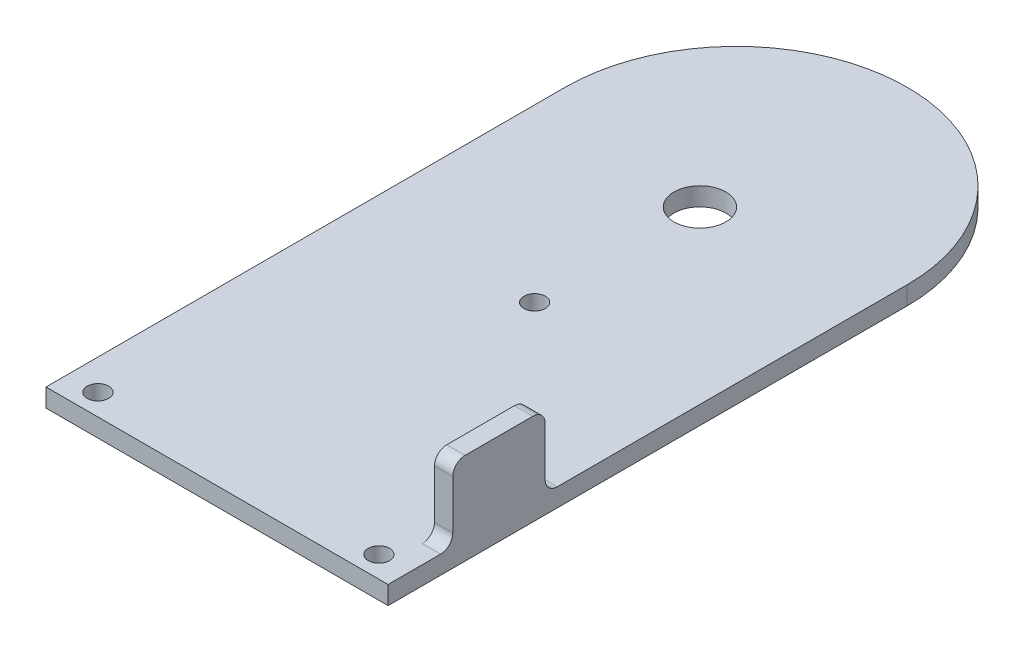
ISO-10303-21;
HEADER;
FILE_DESCRIPTION(('STEP AP214'),'2;1');
FILE_NAME('part.step','',(''),(''),'','','');
FILE_SCHEMA(('AUTOMOTIVE_DESIGN { 1 0 10303 214 1 1 1 1 }'));
ENDSEC;
DATA;
#1=APPLICATION_CONTEXT('core data for automotive mechanical design processes');
#2=APPLICATION_PROTOCOL_DEFINITION('international standard','automotive_design',2000,#1);
#3=PRODUCT_CONTEXT('',#1,'mechanical');
#4=PRODUCT('Part','Part','',(#3));
#5=PRODUCT_RELATED_PRODUCT_CATEGORY('part','',(#4));
#6=PRODUCT_DEFINITION_FORMATION('','',#4);
#7=PRODUCT_DEFINITION_CONTEXT('part definition',#1,'design');
#8=PRODUCT_DEFINITION('design','',#6,#7);
#9=PRODUCT_DEFINITION_SHAPE('','',#8);
#10=(LENGTH_UNIT() NAMED_UNIT(*) SI_UNIT(.MILLI.,.METRE.));
#11=(NAMED_UNIT(*) PLANE_ANGLE_UNIT() SI_UNIT($,.RADIAN.));
#12=(NAMED_UNIT(*) SI_UNIT($,.STERADIAN.) SOLID_ANGLE_UNIT());
#13=UNCERTAINTY_MEASURE_WITH_UNIT(LENGTH_MEASURE(1.E-05),#10,'distance_accuracy_value','');
#14=(GEOMETRIC_REPRESENTATION_CONTEXT(3) GLOBAL_UNCERTAINTY_ASSIGNED_CONTEXT((#13)) GLOBAL_UNIT_ASSIGNED_CONTEXT((#10,
#11,#12)) REPRESENTATION_CONTEXT('',''));
#15=CARTESIAN_POINT('',(0.,0.,0.));
#16=DIRECTION('',(0.,0.,1.));
#17=DIRECTION('',(1.,0.,0.));
#18=AXIS2_PLACEMENT_3D('',#15,#16,#17);
#19=CARTESIAN_POINT('',(28.,3.,-3.28618853211554E-08));
#20=DIRECTION('',(0.,1.,0.));
#21=DIRECTION('',(0.,0.,1.));
#22=AXIS2_PLACEMENT_3D('',#19,#20,#21);
#23=PLANE('',#22);
#24=DIRECTION('',(0.,0.,-1.));
#25=VECTOR('',#24,1.);
#26=CARTESIAN_POINT('',(56.,3.,-6.57237706423107E-08));
#27=LINE('',#26,#25);
#28=CARTESIAN_POINT('',(56.,3.,85.));
#29=VERTEX_POINT('',#28);
#30=CARTESIAN_POINT('',(56.,3.,76.4020341698814));
#31=VERTEX_POINT('',#30);
#32=EDGE_CURVE('E203',#29,#31,#27,.T.);
#33=ORIENTED_EDGE('',*,*,#32,.T.);
#34=DIRECTION('',(1.,0.,0.));
#35=VECTOR('',#34,1.);
#36=CARTESIAN_POINT('',(28.,3.,76.4020341698814));
#37=LINE('',#36,#35);
#38=CARTESIAN_POINT('',(53.,3.,76.4020341698814));
#39=VERTEX_POINT('',#38);
#40=EDGE_CURVE('E165',#31,#39,#37,.F.);
#41=ORIENTED_EDGE('',*,*,#40,.T.);
#42=DIRECTION('',(0.,0.,1.));
#43=VECTOR('',#42,1.);
#44=CARTESIAN_POINT('',(53.,3.,74.4020341698814));
#45=LINE('',#44,#43);
#46=CARTESIAN_POINT('',(53.,3.,57.2862585671108));
#47=VERTEX_POINT('',#46);
#48=EDGE_CURVE('E191',#47,#39,#45,.T.);
#49=ORIENTED_EDGE('',*,*,#48,.F.);
#50=DIRECTION('',(-1.,0.,0.));
#51=VECTOR('',#50,1.);
#52=CARTESIAN_POINT('',(28.,3.,57.2862585671108));
#53=LINE('',#52,#51);
#54=CARTESIAN_POINT('',(56.,3.,57.2862585671108));
#55=VERTEX_POINT('',#54);
#56=EDGE_CURVE('E163',#47,#55,#53,.F.);
#57=ORIENTED_EDGE('',*,*,#56,.T.);
#58=CARTESIAN_POINT('',(56.,3.,-6.57237706423107E-08));
#59=VERTEX_POINT('',#58);
#60=EDGE_CURVE('E144',#55,#59,#27,.T.);
#61=ORIENTED_EDGE('',*,*,#60,.T.);
#62=CARTESIAN_POINT('',(28.,3.,-3.28618853211554E-08));
#63=DIRECTION('',(0.,1.,0.));
#64=DIRECTION('',(0.,0.,1.));
#65=AXIS2_PLACEMENT_3D('',#62,#63,#64);
#66=CIRCLE('',#65,28.);
#67=CARTESIAN_POINT('',(0.,3.,0.));
#68=VERTEX_POINT('',#67);
#69=EDGE_CURVE('E138',#59,#68,#66,.T.);
#70=ORIENTED_EDGE('',*,*,#69,.T.);
#71=DIRECTION('',(0.,0.,1.));
#72=VECTOR('',#71,1.);
#73=CARTESIAN_POINT('',(0.,3.,0.));
#74=LINE('',#73,#72);
#75=CARTESIAN_POINT('',(0.,3.,85.));
#76=VERTEX_POINT('',#75);
#77=EDGE_CURVE('E127',#68,#76,#74,.T.);
#78=ORIENTED_EDGE('',*,*,#77,.T.);
#79=DIRECTION('',(1.,0.,0.));
#80=VECTOR('',#79,1.);
#81=CARTESIAN_POINT('',(0.,3.,85.));
#82=LINE('',#81,#80);
#83=EDGE_CURVE('E137',#76,#29,#82,.T.);
#84=ORIENTED_EDGE('',*,*,#83,.T.);
#85=EDGE_LOOP('',(#33,#41,#49,#57,#61,#70,#78,#84));
#86=FACE_BOUND('',#85,.T.);
#87=CARTESIAN_POINT('',(28.,3.,33.));
#88=DIRECTION('',(0.,1.,0.));
#89=DIRECTION('',(0.,0.,1.));
#90=AXIS2_PLACEMENT_3D('',#87,#88,#89);
#91=CIRCLE('',#90,1.75);
#92=CARTESIAN_POINT('',(28.,3.,34.75));
#93=VERTEX_POINT('',#92);
#94=EDGE_CURVE('E252',#93,#93,#91,.T.);
#95=ORIENTED_EDGE('',*,*,#94,.F.);
#96=EDGE_LOOP('',(#95));
#97=FACE_BOUND('',#96,.T.);
#98=CARTESIAN_POINT('',(5.00000000000001,3.,81.5));
#99=DIRECTION('',(0.,1.,0.));
#100=DIRECTION('',(0.,0.,1.));
#101=AXIS2_PLACEMENT_3D('',#98,#99,#100);
#102=CIRCLE('',#101,1.75);
#103=CARTESIAN_POINT('',(5.00000000000001,3.,83.25));
#104=VERTEX_POINT('',#103);
#105=EDGE_CURVE('E209',#104,#104,#102,.T.);
#106=ORIENTED_EDGE('',*,*,#105,.F.);
#107=EDGE_LOOP('',(#106));
#108=FACE_BOUND('',#107,.T.);
#109=CARTESIAN_POINT('',(51.,3.,81.5));
#110=DIRECTION('',(0.,1.,0.));
#111=DIRECTION('',(0.,0.,1.));
#112=AXIS2_PLACEMENT_3D('',#109,#110,#111);
#113=CIRCLE('',#112,1.75);
#114=CARTESIAN_POINT('',(51.,3.,83.25));
#115=VERTEX_POINT('',#114);
#116=EDGE_CURVE('E258',#115,#115,#113,.T.);
#117=ORIENTED_EDGE('',*,*,#116,.F.);
#118=EDGE_LOOP('',(#117));
#119=FACE_BOUND('',#118,.T.);
#120=CARTESIAN_POINT('',(28.,3.,5.94000000000001));
#121=DIRECTION('',(0.,1.,0.));
#122=DIRECTION('',(0.,0.,1.));
#123=AXIS2_PLACEMENT_3D('',#120,#121,#122);
#124=CIRCLE('',#123,4.25);
#125=CARTESIAN_POINT('',(28.,3.,10.19));
#126=VERTEX_POINT('',#125);
#127=EDGE_CURVE('E246',#126,#126,#124,.T.);
#128=ORIENTED_EDGE('',*,*,#127,.F.);
#129=EDGE_LOOP('',(#128));
#130=FACE_BOUND('',#129,.T.);
#131=ADVANCED_FACE('F36',(#86,#97,#108,#119,#130),#23,.T.);
#132=CARTESIAN_POINT('',(28.,0.,-3.28618853211554E-08));
#133=DIRECTION('',(0.,1.,0.));
#134=DIRECTION('',(0.,0.,1.));
#135=AXIS2_PLACEMENT_3D('',#132,#133,#134);
#136=PLANE('',#135);
#137=CARTESIAN_POINT('',(28.,0.,-3.28618853211554E-08));
#138=DIRECTION('',(0.,1.,0.));
#139=DIRECTION('',(0.,0.,1.));
#140=AXIS2_PLACEMENT_3D('',#137,#138,#139);
#141=CIRCLE('',#140,28.);
#142=CARTESIAN_POINT('',(56.,0.,-6.57237706423107E-08));
#143=VERTEX_POINT('',#142);
#144=CARTESIAN_POINT('',(0.,0.,0.));
#145=VERTEX_POINT('',#144);
#146=EDGE_CURVE('E152',#143,#145,#141,.T.);
#147=ORIENTED_EDGE('',*,*,#146,.F.);
#148=DIRECTION('',(0.,0.,-1.));
#149=VECTOR('',#148,1.);
#150=CARTESIAN_POINT('',(56.,0.,-6.57237706423107E-08));
#151=LINE('',#150,#149);
#152=CARTESIAN_POINT('',(56.,0.,85.));
#153=VERTEX_POINT('',#152);
#154=EDGE_CURVE('E148',#153,#143,#151,.T.);
#155=ORIENTED_EDGE('',*,*,#154,.F.);
#156=DIRECTION('',(1.,0.,0.));
#157=VECTOR('',#156,1.);
#158=CARTESIAN_POINT('',(0.,0.,85.));
#159=LINE('',#158,#157);
#160=CARTESIAN_POINT('',(0.,0.,85.));
#161=VERTEX_POINT('',#160);
#162=EDGE_CURVE('E211',#161,#153,#159,.T.);
#163=ORIENTED_EDGE('',*,*,#162,.F.);
#164=DIRECTION('',(0.,0.,1.));
#165=VECTOR('',#164,1.);
#166=CARTESIAN_POINT('',(0.,0.,0.));
#167=LINE('',#166,#165);
#168=EDGE_CURVE('E208',#145,#161,#167,.T.);
#169=ORIENTED_EDGE('',*,*,#168,.F.);
#170=EDGE_LOOP('',(#147,#155,#163,#169));
#171=FACE_BOUND('',#170,.T.);
#172=CARTESIAN_POINT('',(5.00000000000001,0.,81.5));
#173=DIRECTION('',(0.,1.,0.));
#174=DIRECTION('',(0.,0.,1.));
#175=AXIS2_PLACEMENT_3D('',#172,#173,#174);
#176=CIRCLE('',#175,1.75);
#177=CARTESIAN_POINT('',(5.00000000000001,0.,83.25));
#178=VERTEX_POINT('',#177);
#179=EDGE_CURVE('E261',#178,#178,#176,.T.);
#180=ORIENTED_EDGE('',*,*,#179,.T.);
#181=EDGE_LOOP('',(#180));
#182=FACE_BOUND('',#181,.T.);
#183=CARTESIAN_POINT('',(51.,0.,81.5));
#184=DIRECTION('',(0.,1.,0.));
#185=DIRECTION('',(0.,0.,1.));
#186=AXIS2_PLACEMENT_3D('',#183,#184,#185);
#187=CIRCLE('',#186,1.75);
#188=CARTESIAN_POINT('',(51.,0.,83.25));
#189=VERTEX_POINT('',#188);
#190=EDGE_CURVE('E255',#189,#189,#187,.T.);
#191=ORIENTED_EDGE('',*,*,#190,.T.);
#192=EDGE_LOOP('',(#191));
#193=FACE_BOUND('',#192,.T.);
#194=CARTESIAN_POINT('',(28.,0.,33.));
#195=DIRECTION('',(0.,1.,0.));
#196=DIRECTION('',(0.,0.,1.));
#197=AXIS2_PLACEMENT_3D('',#194,#195,#196);
#198=CIRCLE('',#197,1.75);
#199=CARTESIAN_POINT('',(28.,0.,34.75));
#200=VERTEX_POINT('',#199);
#201=EDGE_CURVE('E249',#200,#200,#198,.T.);
#202=ORIENTED_EDGE('',*,*,#201,.T.);
#203=EDGE_LOOP('',(#202));
#204=FACE_BOUND('',#203,.T.);
#205=CARTESIAN_POINT('',(28.,0.,5.94000000000001));
#206=DIRECTION('',(0.,1.,0.));
#207=DIRECTION('',(0.,0.,1.));
#208=AXIS2_PLACEMENT_3D('',#205,#206,#207);
#209=CIRCLE('',#208,4.25);
#210=CARTESIAN_POINT('',(28.,0.,10.19));
#211=VERTEX_POINT('',#210);
#212=EDGE_CURVE('E245',#211,#211,#209,.T.);
#213=ORIENTED_EDGE('',*,*,#212,.T.);
#214=EDGE_LOOP('',(#213));
#215=FACE_BOUND('',#214,.T.);
#216=ADVANCED_FACE('F221',(#171,#182,#193,#204,#215),#136,.F.);
#217=CARTESIAN_POINT('',(28.,3.,-3.28618853211554E-08));
#218=DIRECTION('',(0.,-1.,0.));
#219=DIRECTION('',(0.,0.,-1.));
#220=AXIS2_PLACEMENT_3D('',#217,#218,#219);
#221=CYLINDRICAL_SURFACE('',#220,28.);
#222=ORIENTED_EDGE('',*,*,#146,.T.);
#223=DIRECTION('',(0.,-1.,0.));
#224=VECTOR('',#223,1.);
#225=CARTESIAN_POINT('',(0.,3.,0.));
#226=LINE('',#225,#224);
#227=EDGE_CURVE('E131',#68,#145,#226,.T.);
#228=ORIENTED_EDGE('',*,*,#227,.F.);
#229=ORIENTED_EDGE('',*,*,#69,.F.);
#230=DIRECTION('',(0.,-1.,0.));
#231=VECTOR('',#230,1.);
#232=CARTESIAN_POINT('',(56.,3.,-6.57237706423107E-08));
#233=LINE('',#232,#231);
#234=EDGE_CURVE('E202',#59,#143,#233,.T.);
#235=ORIENTED_EDGE('',*,*,#234,.T.);
#236=EDGE_LOOP('',(#222,#228,#229,#235));
#237=FACE_BOUND('',#236,.T.);
#238=ADVANCED_FACE('F150',(#237),#221,.T.);
#239=CARTESIAN_POINT('',(0.,3.,0.));
#240=DIRECTION('',(1.,0.,0.));
#241=DIRECTION('',(0.,0.,-1.));
#242=AXIS2_PLACEMENT_3D('',#239,#240,#241);
#243=PLANE('',#242);
#244=ORIENTED_EDGE('',*,*,#168,.T.);
#245=DIRECTION('',(0.,-1.,0.));
#246=VECTOR('',#245,1.);
#247=CARTESIAN_POINT('',(0.,3.,85.));
#248=LINE('',#247,#246);
#249=EDGE_CURVE('E134',#76,#161,#248,.T.);
#250=ORIENTED_EDGE('',*,*,#249,.F.);
#251=ORIENTED_EDGE('',*,*,#77,.F.);
#252=ORIENTED_EDGE('',*,*,#227,.T.);
#253=EDGE_LOOP('',(#244,#250,#251,#252));
#254=FACE_BOUND('',#253,.T.);
#255=ADVANCED_FACE('F129',(#254),#243,.F.);
#256=CARTESIAN_POINT('',(0.,3.,85.));
#257=DIRECTION('',(0.,0.,-1.));
#258=DIRECTION('',(-1.,0.,0.));
#259=AXIS2_PLACEMENT_3D('',#256,#257,#258);
#260=PLANE('',#259);
#261=ORIENTED_EDGE('',*,*,#162,.T.);
#262=DIRECTION('',(0.,-1.,0.));
#263=VECTOR('',#262,1.);
#264=CARTESIAN_POINT('',(56.,3.,85.));
#265=LINE('',#264,#263);
#266=EDGE_CURVE('E157',#29,#153,#265,.T.);
#267=ORIENTED_EDGE('',*,*,#266,.F.);
#268=ORIENTED_EDGE('',*,*,#83,.F.);
#269=ORIENTED_EDGE('',*,*,#249,.T.);
#270=EDGE_LOOP('',(#261,#267,#268,#269));
#271=FACE_BOUND('',#270,.T.);
#272=ADVANCED_FACE('F223',(#271),#260,.F.);
#273=CARTESIAN_POINT('',(56.,3.,-6.57237706423107E-08));
#274=DIRECTION('',(-1.,0.,0.));
#275=DIRECTION('',(0.,0.,1.));
#276=AXIS2_PLACEMENT_3D('',#273,#274,#275);
#277=PLANE('',#276);
#278=DIRECTION('',(0.,-1.,0.));
#279=VECTOR('',#278,1.);
#280=CARTESIAN_POINT('',(56.,15.,59.2862585671108));
#281=LINE('',#280,#279);
#282=CARTESIAN_POINT('',(56.,13.,59.2862585671108));
#283=VERTEX_POINT('',#282);
#284=CARTESIAN_POINT('',(56.,5.,59.2862585671108));
#285=VERTEX_POINT('',#284);
#286=EDGE_CURVE('E238',#283,#285,#281,.T.);
#287=ORIENTED_EDGE('',*,*,#286,.F.);
#288=CARTESIAN_POINT('',(56.,13.,61.2862585671108));
#289=DIRECTION('',(-1.,0.,0.));
#290=DIRECTION('',(0.,0.,1.));
#291=AXIS2_PLACEMENT_3D('',#288,#289,#290);
#292=CIRCLE('',#291,2.);
#293=CARTESIAN_POINT('',(56.,15.,61.2862585671108));
#294=VERTEX_POINT('',#293);
#295=EDGE_CURVE('E182',#283,#294,#292,.F.);
#296=ORIENTED_EDGE('',*,*,#295,.T.);
#297=DIRECTION('',(0.,0.,-1.));
#298=VECTOR('',#297,1.);
#299=CARTESIAN_POINT('',(56.,15.,74.4020341698814));
#300=LINE('',#299,#298);
#301=CARTESIAN_POINT('',(56.,15.,72.4020341698814));
#302=VERTEX_POINT('',#301);
#303=EDGE_CURVE('E309',#302,#294,#300,.T.);
#304=ORIENTED_EDGE('',*,*,#303,.F.);
#305=CARTESIAN_POINT('',(56.,13.,72.4020341698814));
#306=DIRECTION('',(-1.,0.,0.));
#307=DIRECTION('',(0.,0.,1.));
#308=AXIS2_PLACEMENT_3D('',#305,#306,#307);
#309=CIRCLE('',#308,2.);
#310=CARTESIAN_POINT('',(56.,13.,74.4020341698814));
#311=VERTEX_POINT('',#310);
#312=EDGE_CURVE('E180',#302,#311,#309,.F.);
#313=ORIENTED_EDGE('',*,*,#312,.T.);
#314=DIRECTION('',(0.,-1.,0.));
#315=VECTOR('',#314,1.);
#316=CARTESIAN_POINT('',(56.,15.,74.4020341698814));
#317=LINE('',#316,#315);
#318=CARTESIAN_POINT('',(56.,5.,74.4020341698814));
#319=VERTEX_POINT('',#318);
#320=EDGE_CURVE('E236',#311,#319,#317,.T.);
#321=ORIENTED_EDGE('',*,*,#320,.T.);
#322=CARTESIAN_POINT('',(56.,5.,76.4020341698814));
#323=DIRECTION('',(-1.,0.,0.));
#324=DIRECTION('',(0.,0.,1.));
#325=AXIS2_PLACEMENT_3D('',#322,#323,#324);
#326=CIRCLE('',#325,2.);
#327=EDGE_CURVE('E184',#319,#31,#326,.T.);
#328=ORIENTED_EDGE('',*,*,#327,.T.);
#329=ORIENTED_EDGE('',*,*,#32,.F.);
#330=ORIENTED_EDGE('',*,*,#266,.T.);
#331=ORIENTED_EDGE('',*,*,#154,.T.);
#332=ORIENTED_EDGE('',*,*,#234,.F.);
#333=ORIENTED_EDGE('',*,*,#60,.F.);
#334=CARTESIAN_POINT('',(56.,5.,57.2862585671108));
#335=DIRECTION('',(-1.,0.,0.));
#336=DIRECTION('',(0.,0.,1.));
#337=AXIS2_PLACEMENT_3D('',#334,#335,#336);
#338=CIRCLE('',#337,2.);
#339=EDGE_CURVE('E11',#55,#285,#338,.T.);
#340=ORIENTED_EDGE('',*,*,#339,.T.);
#341=EDGE_LOOP('',(#287,#296,#304,#313,#321,#328,#329,#330,#331,#332,#333,#340));
#342=FACE_BOUND('',#341,.T.);
#343=ADVANCED_FACE('F200',(#342),#277,.F.);
#344=CARTESIAN_POINT('',(5.00000000000001,3.,81.5));
#345=DIRECTION('',(0.,-1.,0.));
#346=DIRECTION('',(0.,0.,-1.));
#347=AXIS2_PLACEMENT_3D('',#344,#345,#346);
#348=CYLINDRICAL_SURFACE('',#347,1.75);
#349=ORIENTED_EDGE('',*,*,#105,.T.);
#350=EDGE_LOOP('',(#349));
#351=FACE_BOUND('',#350,.T.);
#352=ORIENTED_EDGE('',*,*,#179,.F.);
#353=EDGE_LOOP('',(#352));
#354=FACE_BOUND('',#353,.T.);
#355=ADVANCED_FACE('F270',(#351,#354),#348,.F.);
#356=CARTESIAN_POINT('',(51.,3.,81.5));
#357=DIRECTION('',(0.,-1.,0.));
#358=DIRECTION('',(0.,0.,-1.));
#359=AXIS2_PLACEMENT_3D('',#356,#357,#358);
#360=CYLINDRICAL_SURFACE('',#359,1.75);
#361=ORIENTED_EDGE('',*,*,#116,.T.);
#362=EDGE_LOOP('',(#361));
#363=FACE_BOUND('',#362,.T.);
#364=ORIENTED_EDGE('',*,*,#190,.F.);
#365=EDGE_LOOP('',(#364));
#366=FACE_BOUND('',#365,.T.);
#367=ADVANCED_FACE('F272',(#363,#366),#360,.F.);
#368=CARTESIAN_POINT('',(28.,3.,33.));
#369=DIRECTION('',(0.,-1.,0.));
#370=DIRECTION('',(0.,0.,-1.));
#371=AXIS2_PLACEMENT_3D('',#368,#369,#370);
#372=CYLINDRICAL_SURFACE('',#371,1.75);
#373=ORIENTED_EDGE('',*,*,#94,.T.);
#374=EDGE_LOOP('',(#373));
#375=FACE_BOUND('',#374,.T.);
#376=ORIENTED_EDGE('',*,*,#201,.F.);
#377=EDGE_LOOP('',(#376));
#378=FACE_BOUND('',#377,.T.);
#379=ADVANCED_FACE('F279',(#375,#378),#372,.F.);
#380=CARTESIAN_POINT('',(28.,3.,5.94000000000001));
#381=DIRECTION('',(0.,-1.,0.));
#382=DIRECTION('',(0.,0.,-1.));
#383=AXIS2_PLACEMENT_3D('',#380,#381,#382);
#384=CYLINDRICAL_SURFACE('',#383,4.25);
#385=ORIENTED_EDGE('',*,*,#127,.T.);
#386=EDGE_LOOP('',(#385));
#387=FACE_BOUND('',#386,.T.);
#388=ORIENTED_EDGE('',*,*,#212,.F.);
#389=EDGE_LOOP('',(#388));
#390=FACE_BOUND('',#389,.T.);
#391=ADVANCED_FACE('F317',(#387,#390),#384,.F.);
#392=CARTESIAN_POINT('',(56.,15.,59.2862585671108));
#393=DIRECTION('',(0.,0.,1.));
#394=DIRECTION('',(1.,0.,0.));
#395=AXIS2_PLACEMENT_3D('',#392,#393,#394);
#396=PLANE('',#395);
#397=ORIENTED_EDGE('',*,*,#286,.T.);
#398=DIRECTION('',(-1.,0.,0.));
#399=VECTOR('',#398,1.);
#400=CARTESIAN_POINT('',(56.,5.,59.2862585671108));
#401=LINE('',#400,#399);
#402=CARTESIAN_POINT('',(53.,5.,59.2862585671108));
#403=VERTEX_POINT('',#402);
#404=EDGE_CURVE('E170',#285,#403,#401,.T.);
#405=ORIENTED_EDGE('',*,*,#404,.T.);
#406=DIRECTION('',(0.,-1.,0.));
#407=VECTOR('',#406,1.);
#408=CARTESIAN_POINT('',(53.,15.,59.2862585671108));
#409=LINE('',#408,#407);
#410=CARTESIAN_POINT('',(53.,13.,59.2862585671108));
#411=VERTEX_POINT('',#410);
#412=EDGE_CURVE('E193',#411,#403,#409,.T.);
#413=ORIENTED_EDGE('',*,*,#412,.F.);
#414=DIRECTION('',(-1.,0.,0.));
#415=VECTOR('',#414,1.);
#416=CARTESIAN_POINT('',(56.,13.,59.2862585671108));
#417=LINE('',#416,#415);
#418=EDGE_CURVE('E168',#411,#283,#417,.F.);
#419=ORIENTED_EDGE('',*,*,#418,.T.);
#420=EDGE_LOOP('',(#397,#405,#413,#419));
#421=FACE_BOUND('',#420,.T.);
#422=ADVANCED_FACE('F315',(#421),#396,.F.);
#423=CARTESIAN_POINT('',(53.,15.,74.4020341698814));
#424=DIRECTION('',(1.,0.,0.));
#425=DIRECTION('',(0.,0.,-1.));
#426=AXIS2_PLACEMENT_3D('',#423,#424,#425);
#427=PLANE('',#426);
#428=DIRECTION('',(0.,0.,1.));
#429=VECTOR('',#428,1.);
#430=CARTESIAN_POINT('',(53.,15.,74.4020341698814));
#431=LINE('',#430,#429);
#432=CARTESIAN_POINT('',(53.,15.,61.2862585671108));
#433=VERTEX_POINT('',#432);
#434=CARTESIAN_POINT('',(53.,15.,72.4020341698814));
#435=VERTEX_POINT('',#434);
#436=EDGE_CURVE('E240',#433,#435,#431,.T.);
#437=ORIENTED_EDGE('',*,*,#436,.F.);
#438=CARTESIAN_POINT('',(53.,13.,61.2862585671108));
#439=DIRECTION('',(1.,0.,0.));
#440=DIRECTION('',(0.,0.,-1.));
#441=AXIS2_PLACEMENT_3D('',#438,#439,#440);
#442=CIRCLE('',#441,2.);
#443=EDGE_CURVE('E59',#433,#411,#442,.F.);
#444=ORIENTED_EDGE('',*,*,#443,.T.);
#445=ORIENTED_EDGE('',*,*,#412,.T.);
#446=CARTESIAN_POINT('',(53.,5.,57.2862585671108));
#447=DIRECTION('',(1.,0.,0.));
#448=DIRECTION('',(0.,0.,-1.));
#449=AXIS2_PLACEMENT_3D('',#446,#447,#448);
#450=CIRCLE('',#449,2.);
#451=EDGE_CURVE('E44',#403,#47,#450,.T.);
#452=ORIENTED_EDGE('',*,*,#451,.T.);
#453=ORIENTED_EDGE('',*,*,#48,.T.);
#454=CARTESIAN_POINT('',(53.,5.,76.4020341698814));
#455=DIRECTION('',(1.,0.,0.));
#456=DIRECTION('',(0.,0.,-1.));
#457=AXIS2_PLACEMENT_3D('',#454,#455,#456);
#458=CIRCLE('',#457,2.);
#459=CARTESIAN_POINT('',(53.,5.,74.4020341698814));
#460=VERTEX_POINT('',#459);
#461=EDGE_CURVE('E186',#39,#460,#458,.T.);
#462=ORIENTED_EDGE('',*,*,#461,.T.);
#463=DIRECTION('',(0.,-1.,0.));
#464=VECTOR('',#463,1.);
#465=CARTESIAN_POINT('',(53.,15.,74.4020341698814));
#466=LINE('',#465,#464);
#467=CARTESIAN_POINT('',(53.,13.,74.4020341698814));
#468=VERTEX_POINT('',#467);
#469=EDGE_CURVE('E230',#468,#460,#466,.T.);
#470=ORIENTED_EDGE('',*,*,#469,.F.);
#471=CARTESIAN_POINT('',(53.,13.,72.4020341698814));
#472=DIRECTION('',(1.,0.,0.));
#473=DIRECTION('',(0.,0.,-1.));
#474=AXIS2_PLACEMENT_3D('',#471,#472,#473);
#475=CIRCLE('',#474,2.);
#476=EDGE_CURVE('E51',#468,#435,#475,.F.);
#477=ORIENTED_EDGE('',*,*,#476,.T.);
#478=EDGE_LOOP('',(#437,#444,#445,#452,#453,#462,#470,#477));
#479=FACE_BOUND('',#478,.T.);
#480=ADVANCED_FACE('F190',(#479),#427,.F.);
#481=CARTESIAN_POINT('',(56.,15.,74.4020341698814));
#482=DIRECTION('',(0.,0.,-1.));
#483=DIRECTION('',(-1.,0.,0.));
#484=AXIS2_PLACEMENT_3D('',#481,#482,#483);
#485=PLANE('',#484);
#486=ORIENTED_EDGE('',*,*,#469,.T.);
#487=DIRECTION('',(1.,0.,0.));
#488=VECTOR('',#487,1.);
#489=CARTESIAN_POINT('',(56.,5.,74.4020341698814));
#490=LINE('',#489,#488);
#491=EDGE_CURVE('E155',#460,#319,#490,.T.);
#492=ORIENTED_EDGE('',*,*,#491,.T.);
#493=ORIENTED_EDGE('',*,*,#320,.F.);
#494=DIRECTION('',(1.,0.,0.));
#495=VECTOR('',#494,1.);
#496=CARTESIAN_POINT('',(53.,13.,74.4020341698814));
#497=LINE('',#496,#495);
#498=EDGE_CURVE('E153',#311,#468,#497,.F.);
#499=ORIENTED_EDGE('',*,*,#498,.T.);
#500=EDGE_LOOP('',(#486,#492,#493,#499));
#501=FACE_BOUND('',#500,.T.);
#502=ADVANCED_FACE('F232',(#501),#485,.F.);
#503=CARTESIAN_POINT('',(0.,15.,0.));
#504=DIRECTION('',(0.,1.,0.));
#505=DIRECTION('',(0.,0.,1.));
#506=AXIS2_PLACEMENT_3D('',#503,#504,#505);
#507=PLANE('',#506);
#508=ORIENTED_EDGE('',*,*,#303,.T.);
#509=DIRECTION('',(-1.,0.,0.));
#510=VECTOR('',#509,1.);
#511=CARTESIAN_POINT('',(53.,15.,61.2862585671108));
#512=LINE('',#511,#510);
#513=EDGE_CURVE('E176',#294,#433,#512,.T.);
#514=ORIENTED_EDGE('',*,*,#513,.T.);
#515=ORIENTED_EDGE('',*,*,#436,.T.);
#516=DIRECTION('',(1.,0.,0.));
#517=VECTOR('',#516,1.);
#518=CARTESIAN_POINT('',(56.,15.,72.4020341698814));
#519=LINE('',#518,#517);
#520=EDGE_CURVE('E173',#435,#302,#519,.T.);
#521=ORIENTED_EDGE('',*,*,#520,.T.);
#522=EDGE_LOOP('',(#508,#514,#515,#521));
#523=FACE_BOUND('',#522,.T.);
#524=ADVANCED_FACE('F298',(#523),#507,.T.);
#525=CARTESIAN_POINT('',(56.,5.,76.4020341698814));
#526=DIRECTION('',(1.,0.,0.));
#527=DIRECTION('',(0.,0.,-1.));
#528=AXIS2_PLACEMENT_3D('',#525,#526,#527);
#529=CYLINDRICAL_SURFACE('',#528,2.);
#530=ORIENTED_EDGE('',*,*,#461,.F.);
#531=ORIENTED_EDGE('',*,*,#40,.F.);
#532=ORIENTED_EDGE('',*,*,#327,.F.);
#533=ORIENTED_EDGE('',*,*,#491,.F.);
#534=EDGE_LOOP('',(#530,#531,#532,#533));
#535=FACE_BOUND('',#534,.T.);
#536=ADVANCED_FACE('F227',(#535),#529,.F.);
#537=CARTESIAN_POINT('',(56.,5.,57.2862585671108));
#538=DIRECTION('',(-1.,0.,0.));
#539=DIRECTION('',(0.,0.,1.));
#540=AXIS2_PLACEMENT_3D('',#537,#538,#539);
#541=CYLINDRICAL_SURFACE('',#540,2.);
#542=ORIENTED_EDGE('',*,*,#339,.F.);
#543=ORIENTED_EDGE('',*,*,#56,.F.);
#544=ORIENTED_EDGE('',*,*,#451,.F.);
#545=ORIENTED_EDGE('',*,*,#404,.F.);
#546=EDGE_LOOP('',(#542,#543,#544,#545));
#547=FACE_BOUND('',#546,.T.);
#548=ADVANCED_FACE('F197',(#547),#541,.F.);
#549=CARTESIAN_POINT('',(0.,13.,61.2862585671108));
#550=DIRECTION('',(1.,0.,0.));
#551=DIRECTION('',(0.,0.,-1.));
#552=AXIS2_PLACEMENT_3D('',#549,#550,#551);
#553=CYLINDRICAL_SURFACE('',#552,2.);
#554=ORIENTED_EDGE('',*,*,#295,.F.);
#555=ORIENTED_EDGE('',*,*,#418,.F.);
#556=ORIENTED_EDGE('',*,*,#443,.F.);
#557=ORIENTED_EDGE('',*,*,#513,.F.);
#558=EDGE_LOOP('',(#554,#555,#556,#557));
#559=FACE_BOUND('',#558,.T.);
#560=ADVANCED_FACE('F300',(#559),#553,.T.);
#561=CARTESIAN_POINT('',(0.,13.,72.4020341698814));
#562=DIRECTION('',(-1.,0.,0.));
#563=DIRECTION('',(0.,0.,1.));
#564=AXIS2_PLACEMENT_3D('',#561,#562,#563);
#565=CYLINDRICAL_SURFACE('',#564,2.);
#566=ORIENTED_EDGE('',*,*,#476,.F.);
#567=ORIENTED_EDGE('',*,*,#498,.F.);
#568=ORIENTED_EDGE('',*,*,#312,.F.);
#569=ORIENTED_EDGE('',*,*,#520,.F.);
#570=EDGE_LOOP('',(#566,#567,#568,#569));
#571=FACE_BOUND('',#570,.T.);
#572=ADVANCED_FACE('F38',(#571),#565,.T.);
#573=CLOSED_SHELL('',(#131,#216,#238,#255,#272,#343,#355,#367,#379,#391,#422,#480,#502,#524,
#536,#548,#560,#572));
#574=MANIFOLD_SOLID_BREP('B2',#573);
#575=ADVANCED_BREP_SHAPE_REPRESENTATION('',(#18,#574),#14);
#576=SHAPE_DEFINITION_REPRESENTATION(#9,#575);
ENDSEC;
END-ISO-10303-21;
